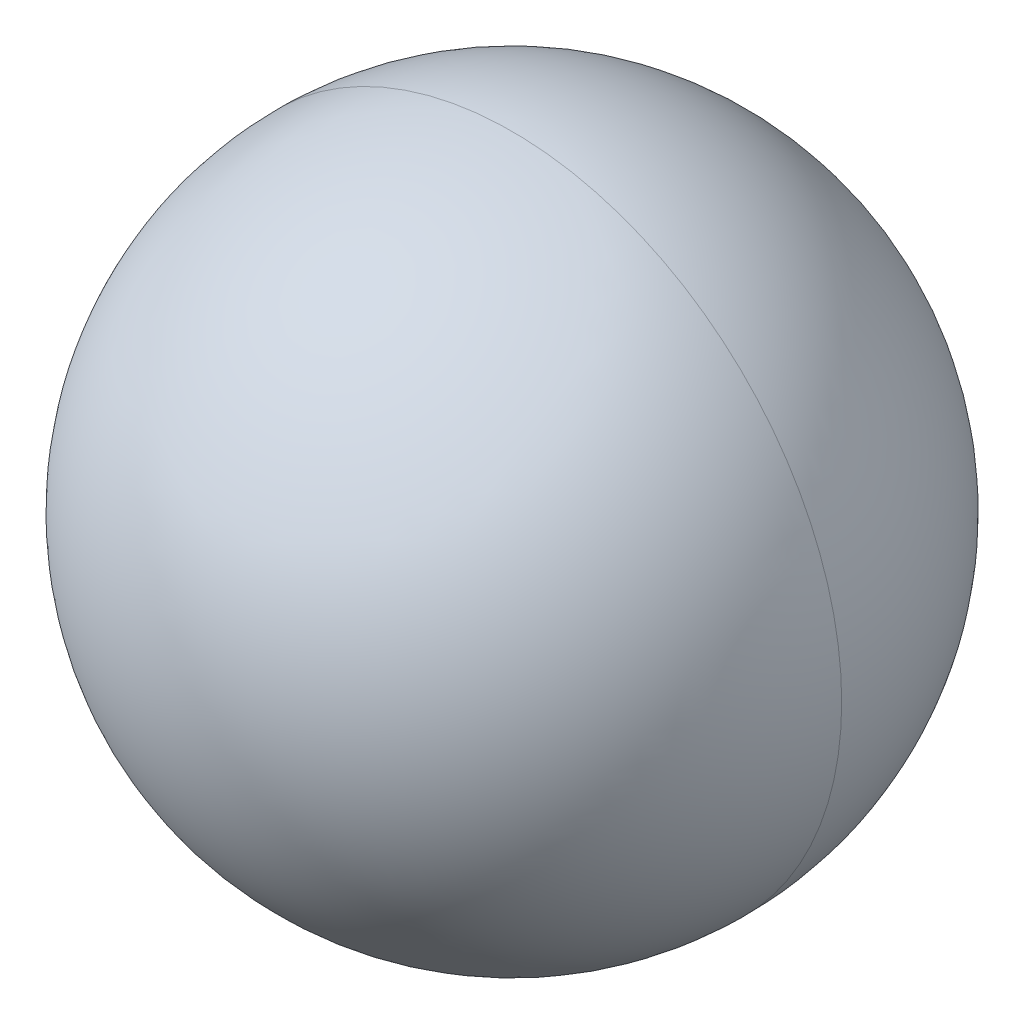
ISO-10303-21;
HEADER;
FILE_DESCRIPTION(('STEP AP214'),'2;1');
FILE_NAME('part.step','',(''),(''),'','','');
FILE_SCHEMA(('AUTOMOTIVE_DESIGN { 1 0 10303 214 1 1 1 1 }'));
ENDSEC;
DATA;
#1=APPLICATION_CONTEXT('core data for automotive mechanical design processes');
#2=APPLICATION_PROTOCOL_DEFINITION('international standard','automotive_design',2000,#1);
#3=PRODUCT_CONTEXT('',#1,'mechanical');
#4=PRODUCT('Part','Part','',(#3));
#5=PRODUCT_RELATED_PRODUCT_CATEGORY('part','',(#4));
#6=PRODUCT_DEFINITION_FORMATION('','',#4);
#7=PRODUCT_DEFINITION_CONTEXT('part definition',#1,'design');
#8=PRODUCT_DEFINITION('design','',#6,#7);
#9=PRODUCT_DEFINITION_SHAPE('','',#8);
#10=(LENGTH_UNIT() NAMED_UNIT(*) SI_UNIT(.MILLI.,.METRE.));
#11=(NAMED_UNIT(*) PLANE_ANGLE_UNIT() SI_UNIT($,.RADIAN.));
#12=(NAMED_UNIT(*) SI_UNIT($,.STERADIAN.) SOLID_ANGLE_UNIT());
#13=UNCERTAINTY_MEASURE_WITH_UNIT(LENGTH_MEASURE(1.E-05),#10,'distance_accuracy_value','');
#14=(GEOMETRIC_REPRESENTATION_CONTEXT(3) GLOBAL_UNCERTAINTY_ASSIGNED_CONTEXT((#13)) GLOBAL_UNIT_ASSIGNED_CONTEXT((#10,
#11,#12)) REPRESENTATION_CONTEXT('',''));
#15=CARTESIAN_POINT('',(0.,0.,0.));
#16=DIRECTION('',(0.,0.,1.));
#17=DIRECTION('',(1.,0.,0.));
#18=AXIS2_PLACEMENT_3D('',#15,#16,#17);
#19=CARTESIAN_POINT('',(3.5,7.35,0.));
#20=DIRECTION('',(1.,0.,0.));
#21=DIRECTION('',(0.,0.,-1.));
#22=AXIS2_PLACEMENT_3D('',#19,#20,#21);
#23=SPHERICAL_SURFACE('',#22,1.9845);
#24=CARTESIAN_POINT('',(3.5,7.35,0.));
#25=DIRECTION('',(0.,0.,1.));
#26=DIRECTION('',(1.,0.,0.));
#27=AXIS2_PLACEMENT_3D('',#24,#25,#26);
#28=CIRCLE('',#27,1.9845);
#29=CARTESIAN_POINT('',(5.4845,7.35,0.));
#30=VERTEX_POINT('',#29);
#31=CARTESIAN_POINT('',(1.5155,7.35,0.));
#32=VERTEX_POINT('',#31);
#33=EDGE_CURVE('E11',#30,#32,#28,.T.);
#34=ORIENTED_EDGE('',*,*,#33,.T.);
#35=CARTESIAN_POINT('',(3.5,7.35,0.));
#36=DIRECTION('',(0.,0.,-1.));
#37=DIRECTION('',(1.,0.,0.));
#38=AXIS2_PLACEMENT_3D('',#35,#36,#37);
#39=CIRCLE('',#38,1.9845);
#40=EDGE_CURVE('E25',#30,#32,#39,.T.);
#41=ORIENTED_EDGE('',*,*,#40,.F.);
#42=EDGE_LOOP('',(#34,#41));
#43=FACE_BOUND('',#42,.T.);
#44=ADVANCED_FACE('F17',(#43),#23,.T.);
#45=CARTESIAN_POINT('',(3.5,7.35,0.));
#46=DIRECTION('',(1.,0.,0.));
#47=DIRECTION('',(0.,0.,1.));
#48=AXIS2_PLACEMENT_3D('',#45,#46,#47);
#49=SPHERICAL_SURFACE('',#48,1.9845);
#50=ORIENTED_EDGE('',*,*,#33,.F.);
#51=ORIENTED_EDGE('',*,*,#40,.T.);
#52=EDGE_LOOP('',(#50,#51));
#53=FACE_BOUND('',#52,.T.);
#54=ADVANCED_FACE('F33',(#53),#49,.T.);
#55=CLOSED_SHELL('',(#44,#54));
#56=MANIFOLD_SOLID_BREP('B1',#55);
#57=ADVANCED_BREP_SHAPE_REPRESENTATION('',(#18,#56),#14);
#58=SHAPE_DEFINITION_REPRESENTATION(#9,#57);
ENDSEC;
END-ISO-10303-21;
